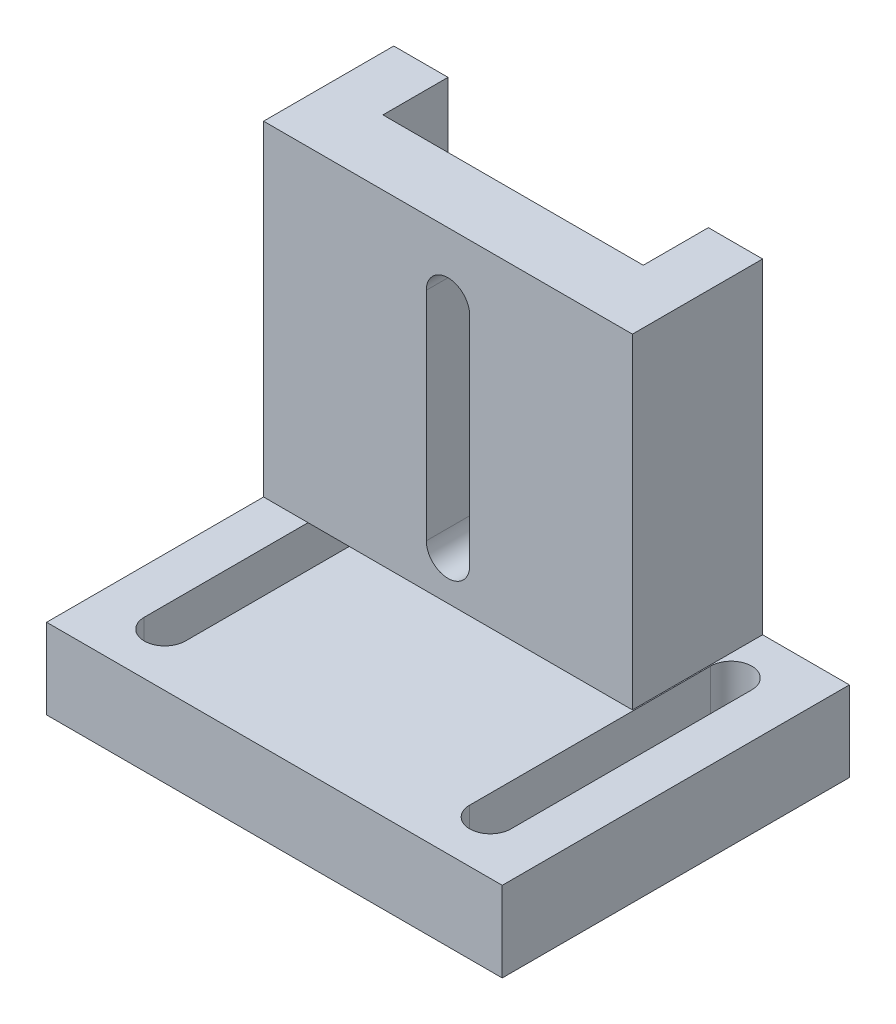
ISO-10303-21;
HEADER;
FILE_DESCRIPTION(('STEP AP214'),'2;1');
FILE_NAME('part.step','',(''),(''),'','','');
FILE_SCHEMA(('AUTOMOTIVE_DESIGN { 1 0 10303 214 1 1 1 1 }'));
ENDSEC;
DATA;
#1=APPLICATION_CONTEXT('core data for automotive mechanical design processes');
#2=APPLICATION_PROTOCOL_DEFINITION('international standard','automotive_design',2000,#1);
#3=PRODUCT_CONTEXT('',#1,'mechanical');
#4=PRODUCT('Part','Part','',(#3));
#5=PRODUCT_RELATED_PRODUCT_CATEGORY('part','',(#4));
#6=PRODUCT_DEFINITION_FORMATION('','',#4);
#7=PRODUCT_DEFINITION_CONTEXT('part definition',#1,'design');
#8=PRODUCT_DEFINITION('design','',#6,#7);
#9=PRODUCT_DEFINITION_SHAPE('','',#8);
#10=(LENGTH_UNIT() NAMED_UNIT(*) SI_UNIT(.MILLI.,.METRE.));
#11=(NAMED_UNIT(*) PLANE_ANGLE_UNIT() SI_UNIT($,.RADIAN.));
#12=(NAMED_UNIT(*) SI_UNIT($,.STERADIAN.) SOLID_ANGLE_UNIT());
#13=UNCERTAINTY_MEASURE_WITH_UNIT(LENGTH_MEASURE(1.E-05),#10,'distance_accuracy_value','');
#14=(GEOMETRIC_REPRESENTATION_CONTEXT(3) GLOBAL_UNCERTAINTY_ASSIGNED_CONTEXT((#13)) GLOBAL_UNIT_ASSIGNED_CONTEXT((#10,
#11,#12)) REPRESENTATION_CONTEXT('',''));
#15=CARTESIAN_POINT('',(0.,0.,0.));
#16=DIRECTION('',(0.,0.,1.));
#17=DIRECTION('',(1.,0.,0.));
#18=AXIS2_PLACEMENT_3D('',#15,#16,#17);
#19=CARTESIAN_POINT('',(0.,3.7,0.));
#20=DIRECTION('',(0.,1.,0.));
#21=DIRECTION('',(0.,0.,1.));
#22=AXIS2_PLACEMENT_3D('',#19,#20,#21);
#23=PLANE('',#22);
#24=DIRECTION('',(-1.,0.,0.));
#25=VECTOR('',#24,1.);
#26=CARTESIAN_POINT('',(-5.,3.7,-8.));
#27=LINE('',#26,#25);
#28=CARTESIAN_POINT('',(4.,3.7,-8.));
#29=VERTEX_POINT('',#28);
#30=CARTESIAN_POINT('',(-8.00000000000001,3.7,-8.));
#31=VERTEX_POINT('',#30);
#32=EDGE_CURVE('E390',#29,#31,#27,.T.);
#33=ORIENTED_EDGE('',*,*,#32,.T.);
#34=DIRECTION('',(0.,0.,1.));
#35=VECTOR('',#34,1.);
#36=CARTESIAN_POINT('',(-8.00000000000001,3.7,-8.));
#37=LINE('',#36,#35);
#38=CARTESIAN_POINT('',(-8.00000000000001,3.7,-6.35777472107018));
#39=VERTEX_POINT('',#38);
#40=EDGE_CURVE('E236',#31,#39,#37,.T.);
#41=ORIENTED_EDGE('',*,*,#40,.T.);
#42=CARTESIAN_POINT('',(-7.5,3.7,-5.55));
#43=DIRECTION('',(0.,1.,0.));
#44=DIRECTION('',(0.,0.,1.));
#45=AXIS2_PLACEMENT_3D('',#42,#43,#44);
#46=CIRCLE('',#45,0.95);
#47=CARTESIAN_POINT('',(-6.55,3.7,-5.55));
#48=VERTEX_POINT('',#47);
#49=EDGE_CURVE('E348',#48,#39,#46,.T.);
#50=ORIENTED_EDGE('',*,*,#49,.F.);
#51=DIRECTION('',(0.,0.,-1.));
#52=VECTOR('',#51,1.);
#53=CARTESIAN_POINT('',(-6.55,3.7,-5.55));
#54=LINE('',#53,#52);
#55=CARTESIAN_POINT('',(-6.55,3.7,-5.));
#56=VERTEX_POINT('',#55);
#57=EDGE_CURVE('E372',#56,#48,#54,.T.);
#58=ORIENTED_EDGE('',*,*,#57,.F.);
#59=DIRECTION('',(1.,0.,0.));
#60=VECTOR('',#59,1.);
#61=CARTESIAN_POINT('',(-10.5,3.7,-5.));
#62=LINE('',#61,#60);
#63=CARTESIAN_POINT('',(4.,3.7,-5.));
#64=VERTEX_POINT('',#63);
#65=EDGE_CURVE('E277',#56,#64,#62,.T.);
#66=ORIENTED_EDGE('',*,*,#65,.T.);
#67=DIRECTION('',(0.,0.,1.));
#68=VECTOR('',#67,1.);
#69=CARTESIAN_POINT('',(4.,3.7,-8.));
#70=LINE('',#69,#68);
#71=EDGE_CURVE('E303',#29,#64,#70,.T.);
#72=ORIENTED_EDGE('',*,*,#71,.F.);
#73=EDGE_LOOP('',(#33,#41,#50,#58,#66,#72));
#74=FACE_BOUND('',#73,.T.);
#75=ADVANCED_FACE('F33',(#74),#23,.T.);
#76=CARTESIAN_POINT('',(0.,0.,-5.));
#77=DIRECTION('',(0.,0.,1.));
#78=DIRECTION('',(1.,0.,0.));
#79=AXIS2_PLACEMENT_3D('',#76,#77,#78);
#80=PLANE('',#79);
#81=DIRECTION('',(0.,1.,0.));
#82=VECTOR('',#81,1.);
#83=CARTESIAN_POINT('',(-1.,15.7,-5.));
#84=LINE('',#83,#82);
#85=CARTESIAN_POINT('',(-1.,5.7,-5.));
#86=VERTEX_POINT('',#85);
#87=CARTESIAN_POINT('',(-1.,15.7,-5.));
#88=VERTEX_POINT('',#87);
#89=EDGE_CURVE('E253',#86,#88,#84,.T.);
#90=ORIENTED_EDGE('',*,*,#89,.T.);
#91=CARTESIAN_POINT('',(-2.,15.7,-5.));
#92=DIRECTION('',(0.,0.,1.));
#93=DIRECTION('',(-1.,0.,0.));
#94=AXIS2_PLACEMENT_3D('',#91,#92,#93);
#95=CIRCLE('',#94,1.);
#96=CARTESIAN_POINT('',(-3.,15.7,-5.));
#97=VERTEX_POINT('',#96);
#98=EDGE_CURVE('E243',#88,#97,#95,.T.);
#99=ORIENTED_EDGE('',*,*,#98,.T.);
#100=DIRECTION('',(0.,-1.,0.));
#101=VECTOR('',#100,1.);
#102=CARTESIAN_POINT('',(-3.,15.7,-5.));
#103=LINE('',#102,#101);
#104=CARTESIAN_POINT('',(-3.,5.7,-5.));
#105=VERTEX_POINT('',#104);
#106=EDGE_CURVE('E246',#97,#105,#103,.T.);
#107=ORIENTED_EDGE('',*,*,#106,.T.);
#108=CARTESIAN_POINT('',(-2.,5.7,-5.));
#109=DIRECTION('',(0.,0.,1.));
#110=DIRECTION('',(1.,0.,0.));
#111=AXIS2_PLACEMENT_3D('',#108,#109,#110);
#112=CIRCLE('',#111,1.);
#113=EDGE_CURVE('E250',#105,#86,#112,.T.);
#114=ORIENTED_EDGE('',*,*,#113,.T.);
#115=EDGE_LOOP('',(#90,#99,#107,#114));
#116=FACE_BOUND('',#115,.T.);
#117=DIRECTION('',(0.,-1.,0.));
#118=VECTOR('',#117,1.);
#119=CARTESIAN_POINT('',(-8.,18.7,-5.));
#120=LINE('',#119,#118);
#121=CARTESIAN_POINT('',(-8.,18.7,-5.));
#122=VERTEX_POINT('',#121);
#123=CARTESIAN_POINT('',(-8.,3.7,-5.));
#124=VERTEX_POINT('',#123);
#125=EDGE_CURVE('E50',#122,#124,#120,.T.);
#126=ORIENTED_EDGE('',*,*,#125,.F.);
#127=DIRECTION('',(-1.,0.,0.));
#128=VECTOR('',#127,1.);
#129=CARTESIAN_POINT('',(-10.5,18.7,-5.));
#130=LINE('',#129,#128);
#131=CARTESIAN_POINT('',(4.,18.7,-5.));
#132=VERTEX_POINT('',#131);
#133=EDGE_CURVE('E275',#132,#122,#130,.T.);
#134=ORIENTED_EDGE('',*,*,#133,.F.);
#135=DIRECTION('',(0.,1.,0.));
#136=VECTOR('',#135,1.);
#137=CARTESIAN_POINT('',(4.,18.7,-5.));
#138=LINE('',#137,#136);
#139=EDGE_CURVE('E290',#64,#132,#138,.T.);
#140=ORIENTED_EDGE('',*,*,#139,.F.);
#141=ORIENTED_EDGE('',*,*,#65,.F.);
#142=EDGE_CURVE('E223',#124,#56,#62,.T.);
#143=ORIENTED_EDGE('',*,*,#142,.F.);
#144=EDGE_LOOP('',(#126,#134,#140,#141,#143));
#145=FACE_BOUND('',#144,.T.);
#146=ADVANCED_FACE('F408',(#116,#145),#80,.F.);
#147=DIRECTION('',(1.,0.,0.));
#148=VECTOR('',#147,1.);
#149=CARTESIAN_POINT('',(-10.5,3.7,-2.));
#150=LINE('',#149,#148);
#151=CARTESIAN_POINT('',(-10.5,3.7,-2.));
#152=VERTEX_POINT('',#151);
#153=CARTESIAN_POINT('',(-8.45,3.7,-2.));
#154=VERTEX_POINT('',#153);
#155=EDGE_CURVE('E278',#152,#154,#150,.T.);
#156=ORIENTED_EDGE('',*,*,#155,.F.);
#157=DIRECTION('',(0.,0.,-1.));
#158=VECTOR('',#157,1.);
#159=CARTESIAN_POINT('',(-10.5,3.7,8.));
#160=LINE('',#159,#158);
#161=CARTESIAN_POINT('',(-10.5,3.7,8.));
#162=VERTEX_POINT('',#161);
#163=EDGE_CURVE('E212',#162,#152,#160,.T.);
#164=ORIENTED_EDGE('',*,*,#163,.F.);
#165=DIRECTION('',(1.,0.,0.));
#166=VECTOR('',#165,1.);
#167=CARTESIAN_POINT('',(-5.,3.7,8.));
#168=LINE('',#167,#166);
#169=CARTESIAN_POINT('',(10.5,3.7,8.));
#170=VERTEX_POINT('',#169);
#171=EDGE_CURVE('E11',#162,#170,#168,.T.);
#172=ORIENTED_EDGE('',*,*,#171,.T.);
#173=DIRECTION('',(0.,0.,-1.));
#174=VECTOR('',#173,1.);
#175=CARTESIAN_POINT('',(10.5,3.7,8.));
#176=LINE('',#175,#174);
#177=CARTESIAN_POINT('',(10.5,3.7,-8.));
#178=VERTEX_POINT('',#177);
#179=EDGE_CURVE('E340',#170,#178,#176,.T.);
#180=ORIENTED_EDGE('',*,*,#179,.T.);
#181=CARTESIAN_POINT('',(6.5,3.7,-8.));
#182=VERTEX_POINT('',#181);
#183=EDGE_CURVE('E42',#178,#182,#27,.T.);
#184=ORIENTED_EDGE('',*,*,#183,.T.);
#185=DIRECTION('',(0.,0.,1.));
#186=VECTOR('',#185,1.);
#187=CARTESIAN_POINT('',(6.5,3.7,-8.));
#188=LINE('',#187,#186);
#189=CARTESIAN_POINT('',(6.5,3.7,-2.));
#190=VERTEX_POINT('',#189);
#191=EDGE_CURVE('E306',#182,#190,#188,.T.);
#192=ORIENTED_EDGE('',*,*,#191,.T.);
#193=CARTESIAN_POINT('',(-6.55,3.7,-2.));
#194=VERTEX_POINT('',#193);
#195=EDGE_CURVE('E285',#194,#190,#150,.T.);
#196=ORIENTED_EDGE('',*,*,#195,.F.);
#197=CARTESIAN_POINT('',(-6.55,3.7,5.55));
#198=VERTEX_POINT('',#197);
#199=EDGE_CURVE('E355',#198,#194,#54,.T.);
#200=ORIENTED_EDGE('',*,*,#199,.F.);
#201=CARTESIAN_POINT('',(-7.5,3.7,5.55));
#202=DIRECTION('',(0.,1.,0.));
#203=DIRECTION('',(0.,0.,1.));
#204=AXIS2_PLACEMENT_3D('',#201,#202,#203);
#205=CIRCLE('',#204,0.95);
#206=CARTESIAN_POINT('',(-8.45,3.7,5.55));
#207=VERTEX_POINT('',#206);
#208=EDGE_CURVE('E369',#207,#198,#205,.T.);
#209=ORIENTED_EDGE('',*,*,#208,.F.);
#210=DIRECTION('',(0.,0.,1.));
#211=VECTOR('',#210,1.);
#212=CARTESIAN_POINT('',(-8.45,3.7,-5.55));
#213=LINE('',#212,#211);
#214=EDGE_CURVE('E367',#154,#207,#213,.T.);
#215=ORIENTED_EDGE('',*,*,#214,.F.);
#216=EDGE_LOOP('',(#156,#164,#172,#180,#184,#192,#196,#200,#209,#215));
#217=FACE_BOUND('',#216,.T.);
#218=DIRECTION('',(0.,0.,-1.));
#219=VECTOR('',#218,1.);
#220=CARTESIAN_POINT('',(6.55,3.7,-5.55));
#221=LINE('',#220,#219);
#222=CARTESIAN_POINT('',(6.55,3.7,5.55));
#223=VERTEX_POINT('',#222);
#224=CARTESIAN_POINT('',(6.55,3.7,-5.55));
#225=VERTEX_POINT('',#224);
#226=EDGE_CURVE('E322',#223,#225,#221,.T.);
#227=ORIENTED_EDGE('',*,*,#226,.T.);
#228=CARTESIAN_POINT('',(7.5,3.7,-5.55));
#229=DIRECTION('',(0.,-1.,0.));
#230=DIRECTION('',(0.,0.,1.));
#231=AXIS2_PLACEMENT_3D('',#228,#229,#230);
#232=CIRCLE('',#231,0.95);
#233=CARTESIAN_POINT('',(8.45,3.7,-5.55));
#234=VERTEX_POINT('',#233);
#235=EDGE_CURVE('E308',#225,#234,#232,.T.);
#236=ORIENTED_EDGE('',*,*,#235,.T.);
#237=DIRECTION('',(0.,0.,1.));
#238=VECTOR('',#237,1.);
#239=CARTESIAN_POINT('',(8.45,3.7,-5.55));
#240=LINE('',#239,#238);
#241=CARTESIAN_POINT('',(8.45,3.7,5.55));
#242=VERTEX_POINT('',#241);
#243=EDGE_CURVE('E312',#234,#242,#240,.T.);
#244=ORIENTED_EDGE('',*,*,#243,.T.);
#245=CARTESIAN_POINT('',(7.5,3.7,5.55));
#246=DIRECTION('',(0.,-1.,0.));
#247=DIRECTION('',(0.,0.,1.));
#248=AXIS2_PLACEMENT_3D('',#245,#246,#247);
#249=CIRCLE('',#248,0.95);
#250=EDGE_CURVE('E325',#242,#223,#249,.T.);
#251=ORIENTED_EDGE('',*,*,#250,.T.);
#252=EDGE_LOOP('',(#227,#236,#244,#251));
#253=FACE_BOUND('',#252,.T.);
#254=ADVANCED_FACE('F423',(#217,#253),#23,.T.);
#255=CARTESIAN_POINT('',(0.,0.,0.));
#256=DIRECTION('',(0.,1.,0.));
#257=DIRECTION('',(0.,0.,1.));
#258=AXIS2_PLACEMENT_3D('',#255,#256,#257);
#259=PLANE('',#258);
#260=DIRECTION('',(-1.,0.,0.));
#261=VECTOR('',#260,1.);
#262=CARTESIAN_POINT('',(-5.,0.,-8.));
#263=LINE('',#262,#261);
#264=CARTESIAN_POINT('',(10.5,0.,-8.));
#265=VERTEX_POINT('',#264);
#266=CARTESIAN_POINT('',(-10.5,0.,-8.));
#267=VERTEX_POINT('',#266);
#268=EDGE_CURVE('E207',#265,#267,#263,.T.);
#269=ORIENTED_EDGE('',*,*,#268,.F.);
#270=DIRECTION('',(0.,0.,-1.));
#271=VECTOR('',#270,1.);
#272=CARTESIAN_POINT('',(10.5,0.,8.));
#273=LINE('',#272,#271);
#274=CARTESIAN_POINT('',(10.5,0.,8.));
#275=VERTEX_POINT('',#274);
#276=EDGE_CURVE('E333',#275,#265,#273,.T.);
#277=ORIENTED_EDGE('',*,*,#276,.F.);
#278=DIRECTION('',(1.,0.,0.));
#279=VECTOR('',#278,1.);
#280=CARTESIAN_POINT('',(-5.,0.,8.));
#281=LINE('',#280,#279);
#282=CARTESIAN_POINT('',(-10.5,0.,8.));
#283=VERTEX_POINT('',#282);
#284=EDGE_CURVE('E37',#283,#275,#281,.T.);
#285=ORIENTED_EDGE('',*,*,#284,.F.);
#286=DIRECTION('',(0.,0.,-1.));
#287=VECTOR('',#286,1.);
#288=CARTESIAN_POINT('',(-10.5,0.,8.));
#289=LINE('',#288,#287);
#290=EDGE_CURVE('E378',#283,#267,#289,.T.);
#291=ORIENTED_EDGE('',*,*,#290,.T.);
#292=EDGE_LOOP('',(#269,#277,#285,#291));
#293=FACE_BOUND('',#292,.T.);
#294=DIRECTION('',(0.,0.,-1.));
#295=VECTOR('',#294,1.);
#296=CARTESIAN_POINT('',(-6.55,0.,-5.55));
#297=LINE('',#296,#295);
#298=CARTESIAN_POINT('',(-6.55,0.,5.55));
#299=VERTEX_POINT('',#298);
#300=CARTESIAN_POINT('',(-6.55,0.,-5.55));
#301=VERTEX_POINT('',#300);
#302=EDGE_CURVE('E361',#299,#301,#297,.T.);
#303=ORIENTED_EDGE('',*,*,#302,.T.);
#304=CARTESIAN_POINT('',(-7.5,0.,-5.55));
#305=DIRECTION('',(0.,1.,0.));
#306=DIRECTION('',(0.,0.,1.));
#307=AXIS2_PLACEMENT_3D('',#304,#305,#306);
#308=CIRCLE('',#307,0.95);
#309=CARTESIAN_POINT('',(-8.45,0.,-5.55));
#310=VERTEX_POINT('',#309);
#311=EDGE_CURVE('E351',#301,#310,#308,.T.);
#312=ORIENTED_EDGE('',*,*,#311,.T.);
#313=DIRECTION('',(0.,0.,1.));
#314=VECTOR('',#313,1.);
#315=CARTESIAN_POINT('',(-8.45,0.,-5.55));
#316=LINE('',#315,#314);
#317=CARTESIAN_POINT('',(-8.45,0.,5.55));
#318=VERTEX_POINT('',#317);
#319=EDGE_CURVE('E354',#310,#318,#316,.T.);
#320=ORIENTED_EDGE('',*,*,#319,.T.);
#321=CARTESIAN_POINT('',(-7.5,0.,5.55));
#322=DIRECTION('',(0.,1.,0.));
#323=DIRECTION('',(0.,0.,1.));
#324=AXIS2_PLACEMENT_3D('',#321,#322,#323);
#325=CIRCLE('',#324,0.95);
#326=EDGE_CURVE('E358',#318,#299,#325,.T.);
#327=ORIENTED_EDGE('',*,*,#326,.T.);
#328=EDGE_LOOP('',(#303,#312,#320,#327));
#329=FACE_BOUND('',#328,.T.);
#330=CARTESIAN_POINT('',(7.5,0.,-5.55));
#331=DIRECTION('',(0.,-1.,0.));
#332=DIRECTION('',(0.,0.,1.));
#333=AXIS2_PLACEMENT_3D('',#330,#331,#332);
#334=CIRCLE('',#333,0.95);
#335=CARTESIAN_POINT('',(6.55,0.,-5.55));
#336=VERTEX_POINT('',#335);
#337=CARTESIAN_POINT('',(8.45,0.,-5.55));
#338=VERTEX_POINT('',#337);
#339=EDGE_CURVE('E309',#336,#338,#334,.T.);
#340=ORIENTED_EDGE('',*,*,#339,.F.);
#341=DIRECTION('',(0.,0.,-1.));
#342=VECTOR('',#341,1.);
#343=CARTESIAN_POINT('',(6.55,0.,-5.55));
#344=LINE('',#343,#342);
#345=CARTESIAN_POINT('',(6.55,0.,5.55));
#346=VERTEX_POINT('',#345);
#347=EDGE_CURVE('E311',#346,#336,#344,.T.);
#348=ORIENTED_EDGE('',*,*,#347,.F.);
#349=CARTESIAN_POINT('',(7.5,0.,5.55));
#350=DIRECTION('',(0.,-1.,0.));
#351=DIRECTION('',(0.,0.,1.));
#352=AXIS2_PLACEMENT_3D('',#349,#350,#351);
#353=CIRCLE('',#352,0.95);
#354=CARTESIAN_POINT('',(8.45,0.,5.55));
#355=VERTEX_POINT('',#354);
#356=EDGE_CURVE('E314',#355,#346,#353,.T.);
#357=ORIENTED_EDGE('',*,*,#356,.F.);
#358=DIRECTION('',(0.,0.,1.));
#359=VECTOR('',#358,1.);
#360=CARTESIAN_POINT('',(8.45,0.,-5.55));
#361=LINE('',#360,#359);
#362=EDGE_CURVE('E317',#338,#355,#361,.T.);
#363=ORIENTED_EDGE('',*,*,#362,.F.);
#364=EDGE_LOOP('',(#340,#348,#357,#363));
#365=FACE_BOUND('',#364,.T.);
#366=ADVANCED_FACE('F439',(#293,#329,#365),#259,.F.);
#367=CARTESIAN_POINT('',(-5.,3.7,-8.));
#368=DIRECTION('',(0.,0.,1.));
#369=DIRECTION('',(1.,0.,0.));
#370=AXIS2_PLACEMENT_3D('',#367,#368,#369);
#371=PLANE('',#370);
#372=ORIENTED_EDGE('',*,*,#268,.T.);
#373=DIRECTION('',(0.,-1.,0.));
#374=VECTOR('',#373,1.);
#375=CARTESIAN_POINT('',(-10.5,3.7,-8.));
#376=LINE('',#375,#374);
#377=CARTESIAN_POINT('',(-10.5,18.7,-8.));
#378=VERTEX_POINT('',#377);
#379=EDGE_CURVE('E201',#378,#267,#376,.T.);
#380=ORIENTED_EDGE('',*,*,#379,.F.);
#381=DIRECTION('',(1.,0.,0.));
#382=VECTOR('',#381,1.);
#383=CARTESIAN_POINT('',(-10.5,18.7,-8.));
#384=LINE('',#383,#382);
#385=CARTESIAN_POINT('',(-8.,18.7,-8.));
#386=VERTEX_POINT('',#385);
#387=EDGE_CURVE('E204',#378,#386,#384,.T.);
#388=ORIENTED_EDGE('',*,*,#387,.T.);
#389=DIRECTION('',(0.,-1.,0.));
#390=VECTOR('',#389,1.);
#391=CARTESIAN_POINT('',(-8.,18.7,-8.));
#392=LINE('',#391,#390);
#393=EDGE_CURVE('E230',#386,#31,#392,.T.);
#394=ORIENTED_EDGE('',*,*,#393,.T.);
#395=ORIENTED_EDGE('',*,*,#32,.F.);
#396=DIRECTION('',(0.,1.,0.));
#397=VECTOR('',#396,1.);
#398=CARTESIAN_POINT('',(4.,18.7,-8.));
#399=LINE('',#398,#397);
#400=CARTESIAN_POINT('',(4.,18.7,-8.));
#401=VERTEX_POINT('',#400);
#402=EDGE_CURVE('E293',#29,#401,#399,.T.);
#403=ORIENTED_EDGE('',*,*,#402,.T.);
#404=DIRECTION('',(1.,0.,0.));
#405=VECTOR('',#404,1.);
#406=CARTESIAN_POINT('',(6.5,18.7,-8.));
#407=LINE('',#406,#405);
#408=CARTESIAN_POINT('',(6.5,18.7,-8.));
#409=VERTEX_POINT('',#408);
#410=EDGE_CURVE('E295',#401,#409,#407,.T.);
#411=ORIENTED_EDGE('',*,*,#410,.T.);
#412=DIRECTION('',(0.,-1.,0.));
#413=VECTOR('',#412,1.);
#414=CARTESIAN_POINT('',(6.5,18.7,-8.));
#415=LINE('',#414,#413);
#416=EDGE_CURVE('E291',#409,#182,#415,.T.);
#417=ORIENTED_EDGE('',*,*,#416,.T.);
#418=ORIENTED_EDGE('',*,*,#183,.F.);
#419=DIRECTION('',(0.,-1.,0.));
#420=VECTOR('',#419,1.);
#421=CARTESIAN_POINT('',(10.5,3.7,-8.));
#422=LINE('',#421,#420);
#423=EDGE_CURVE('E346',#178,#265,#422,.T.);
#424=ORIENTED_EDGE('',*,*,#423,.T.);
#425=EDGE_LOOP('',(#372,#380,#388,#394,#395,#403,#411,#417,#418,#424));
#426=FACE_BOUND('',#425,.T.);
#427=ADVANCED_FACE('F35',(#426),#371,.F.);
#428=CARTESIAN_POINT('',(-5.,3.7,8.));
#429=DIRECTION('',(0.,0.,-1.));
#430=DIRECTION('',(-1.,0.,0.));
#431=AXIS2_PLACEMENT_3D('',#428,#429,#430);
#432=PLANE('',#431);
#433=ORIENTED_EDGE('',*,*,#284,.T.);
#434=DIRECTION('',(0.,-1.,0.));
#435=VECTOR('',#434,1.);
#436=CARTESIAN_POINT('',(10.5,3.7,8.));
#437=LINE('',#436,#435);
#438=EDGE_CURVE('E343',#170,#275,#437,.T.);
#439=ORIENTED_EDGE('',*,*,#438,.F.);
#440=ORIENTED_EDGE('',*,*,#171,.F.);
#441=DIRECTION('',(0.,-1.,0.));
#442=VECTOR('',#441,1.);
#443=CARTESIAN_POINT('',(-10.5,3.7,8.));
#444=LINE('',#443,#442);
#445=EDGE_CURVE('E211',#162,#283,#444,.T.);
#446=ORIENTED_EDGE('',*,*,#445,.T.);
#447=EDGE_LOOP('',(#433,#439,#440,#446));
#448=FACE_BOUND('',#447,.T.);
#449=ADVANCED_FACE('F459',(#448),#432,.F.);
#450=CARTESIAN_POINT('',(-10.5,3.7,8.));
#451=DIRECTION('',(-1.,0.,0.));
#452=DIRECTION('',(0.,0.,1.));
#453=AXIS2_PLACEMENT_3D('',#450,#451,#452);
#454=PLANE('',#453);
#455=DIRECTION('',(0.,0.,1.));
#456=VECTOR('',#455,1.);
#457=CARTESIAN_POINT('',(-10.5,18.7,-5.));
#458=LINE('',#457,#456);
#459=CARTESIAN_POINT('',(-10.5,18.7,-2.));
#460=VERTEX_POINT('',#459);
#461=EDGE_CURVE('E215',#378,#460,#458,.T.);
#462=ORIENTED_EDGE('',*,*,#461,.F.);
#463=ORIENTED_EDGE('',*,*,#379,.T.);
#464=ORIENTED_EDGE('',*,*,#290,.F.);
#465=ORIENTED_EDGE('',*,*,#445,.F.);
#466=ORIENTED_EDGE('',*,*,#163,.T.);
#467=DIRECTION('',(0.,-1.,0.));
#468=VECTOR('',#467,1.);
#469=CARTESIAN_POINT('',(-10.5,3.7,-2.));
#470=LINE('',#469,#468);
#471=EDGE_CURVE('E218',#460,#152,#470,.T.);
#472=ORIENTED_EDGE('',*,*,#471,.F.);
#473=EDGE_LOOP('',(#462,#463,#464,#465,#466,#472));
#474=FACE_BOUND('',#473,.T.);
#475=ADVANCED_FACE('F216',(#474),#454,.T.);
#476=CARTESIAN_POINT('',(-7.5,0.,-5.55));
#477=DIRECTION('',(0.,1.,0.));
#478=DIRECTION('',(0.,0.,1.));
#479=AXIS2_PLACEMENT_3D('',#476,#477,#478);
#480=CYLINDRICAL_SURFACE('',#479,0.95);
#481=ORIENTED_EDGE('',*,*,#49,.T.);
#482=CARTESIAN_POINT('',(-7.5,3.7,-5.55));
#483=DIRECTION('',(0.,1.,0.));
#484=DIRECTION('',(0.,0.,1.));
#485=AXIS2_PLACEMENT_3D('',#482,#483,#484);
#486=CIRCLE('',#485,0.95);
#487=CARTESIAN_POINT('',(-8.45,3.7,-5.55));
#488=VERTEX_POINT('',#487);
#489=EDGE_CURVE('E240',#488,#39,#486,.F.);
#490=ORIENTED_EDGE('',*,*,#489,.F.);
#491=DIRECTION('',(0.,1.,0.));
#492=VECTOR('',#491,1.);
#493=CARTESIAN_POINT('',(-8.45,0.,-5.55));
#494=LINE('',#493,#492);
#495=EDGE_CURVE('E364',#310,#488,#494,.T.);
#496=ORIENTED_EDGE('',*,*,#495,.F.);
#497=ORIENTED_EDGE('',*,*,#311,.F.);
#498=DIRECTION('',(0.,1.,0.));
#499=VECTOR('',#498,1.);
#500=CARTESIAN_POINT('',(-6.55,0.,-5.55));
#501=LINE('',#500,#499);
#502=EDGE_CURVE('E375',#301,#48,#501,.T.);
#503=ORIENTED_EDGE('',*,*,#502,.T.);
#504=EDGE_LOOP('',(#481,#490,#496,#497,#503));
#505=FACE_BOUND('',#504,.T.);
#506=ADVANCED_FACE('F451',(#505),#480,.F.);
#507=CARTESIAN_POINT('',(-6.55,0.,-5.55));
#508=DIRECTION('',(1.,0.,0.));
#509=DIRECTION('',(0.,0.,-1.));
#510=AXIS2_PLACEMENT_3D('',#507,#508,#509);
#511=PLANE('',#510);
#512=ORIENTED_EDGE('',*,*,#199,.T.);
#513=DIRECTION('',(0.,0.,-1.));
#514=VECTOR('',#513,1.);
#515=CARTESIAN_POINT('',(-6.55,3.7,-5.55));
#516=LINE('',#515,#514);
#517=EDGE_CURVE('E222',#194,#56,#516,.T.);
#518=ORIENTED_EDGE('',*,*,#517,.T.);
#519=ORIENTED_EDGE('',*,*,#57,.T.);
#520=ORIENTED_EDGE('',*,*,#502,.F.);
#521=ORIENTED_EDGE('',*,*,#302,.F.);
#522=DIRECTION('',(0.,1.,0.));
#523=VECTOR('',#522,1.);
#524=CARTESIAN_POINT('',(-6.55,0.,5.55));
#525=LINE('',#524,#523);
#526=EDGE_CURVE('E379',#299,#198,#525,.T.);
#527=ORIENTED_EDGE('',*,*,#526,.T.);
#528=EDGE_LOOP('',(#512,#518,#519,#520,#521,#527));
#529=FACE_BOUND('',#528,.T.);
#530=ADVANCED_FACE('F411',(#529),#511,.F.);
#531=CARTESIAN_POINT('',(-7.5,0.,5.55));
#532=DIRECTION('',(0.,1.,0.));
#533=DIRECTION('',(0.,0.,1.));
#534=AXIS2_PLACEMENT_3D('',#531,#532,#533);
#535=CYLINDRICAL_SURFACE('',#534,0.95);
#536=ORIENTED_EDGE('',*,*,#208,.T.);
#537=ORIENTED_EDGE('',*,*,#526,.F.);
#538=ORIENTED_EDGE('',*,*,#326,.F.);
#539=DIRECTION('',(0.,1.,0.));
#540=VECTOR('',#539,1.);
#541=CARTESIAN_POINT('',(-8.45,0.,5.55));
#542=LINE('',#541,#540);
#543=EDGE_CURVE('E381',#318,#207,#542,.T.);
#544=ORIENTED_EDGE('',*,*,#543,.T.);
#545=EDGE_LOOP('',(#536,#537,#538,#544));
#546=FACE_BOUND('',#545,.T.);
#547=ADVANCED_FACE('F446',(#546),#535,.F.);
#548=CARTESIAN_POINT('',(-8.45,0.,-5.55));
#549=DIRECTION('',(-1.,0.,0.));
#550=DIRECTION('',(0.,0.,1.));
#551=AXIS2_PLACEMENT_3D('',#548,#549,#550);
#552=PLANE('',#551);
#553=EDGE_CURVE('E58',#488,#154,#213,.T.);
#554=ORIENTED_EDGE('',*,*,#553,.T.);
#555=ORIENTED_EDGE('',*,*,#214,.T.);
#556=ORIENTED_EDGE('',*,*,#543,.F.);
#557=ORIENTED_EDGE('',*,*,#319,.F.);
#558=ORIENTED_EDGE('',*,*,#495,.T.);
#559=EDGE_LOOP('',(#554,#555,#556,#557,#558));
#560=FACE_BOUND('',#559,.T.);
#561=ADVANCED_FACE('F443',(#560),#552,.F.);
#562=CARTESIAN_POINT('',(10.5,3.7,8.));
#563=DIRECTION('',(-1.,0.,0.));
#564=DIRECTION('',(0.,0.,1.));
#565=AXIS2_PLACEMENT_3D('',#562,#563,#564);
#566=PLANE('',#565);
#567=ORIENTED_EDGE('',*,*,#276,.T.);
#568=ORIENTED_EDGE('',*,*,#423,.F.);
#569=ORIENTED_EDGE('',*,*,#179,.F.);
#570=ORIENTED_EDGE('',*,*,#438,.T.);
#571=EDGE_LOOP('',(#567,#568,#569,#570));
#572=FACE_BOUND('',#571,.T.);
#573=ADVANCED_FACE('F436',(#572),#566,.F.);
#574=CARTESIAN_POINT('',(7.5,0.,-5.55));
#575=DIRECTION('',(0.,1.,0.));
#576=DIRECTION('',(0.,0.,1.));
#577=AXIS2_PLACEMENT_3D('',#574,#575,#576);
#578=CYLINDRICAL_SURFACE('',#577,0.95);
#579=ORIENTED_EDGE('',*,*,#235,.F.);
#580=DIRECTION('',(0.,1.,0.));
#581=VECTOR('',#580,1.);
#582=CARTESIAN_POINT('',(6.55,0.,-5.55));
#583=LINE('',#582,#581);
#584=EDGE_CURVE('E319',#336,#225,#583,.T.);
#585=ORIENTED_EDGE('',*,*,#584,.F.);
#586=ORIENTED_EDGE('',*,*,#339,.T.);
#587=DIRECTION('',(0.,1.,0.));
#588=VECTOR('',#587,1.);
#589=CARTESIAN_POINT('',(8.45,0.,-5.55));
#590=LINE('',#589,#588);
#591=EDGE_CURVE('E330',#338,#234,#590,.T.);
#592=ORIENTED_EDGE('',*,*,#591,.T.);
#593=EDGE_LOOP('',(#579,#585,#586,#592));
#594=FACE_BOUND('',#593,.T.);
#595=ADVANCED_FACE('F618',(#594),#578,.F.);
#596=CARTESIAN_POINT('',(8.45,0.,-5.55));
#597=DIRECTION('',(-1.,0.,0.));
#598=DIRECTION('',(0.,0.,1.));
#599=AXIS2_PLACEMENT_3D('',#596,#597,#598);
#600=PLANE('',#599);
#601=ORIENTED_EDGE('',*,*,#243,.F.);
#602=ORIENTED_EDGE('',*,*,#591,.F.);
#603=ORIENTED_EDGE('',*,*,#362,.T.);
#604=DIRECTION('',(0.,1.,0.));
#605=VECTOR('',#604,1.);
#606=CARTESIAN_POINT('',(8.45,0.,5.55));
#607=LINE('',#606,#605);
#608=EDGE_CURVE('E334',#355,#242,#607,.T.);
#609=ORIENTED_EDGE('',*,*,#608,.T.);
#610=EDGE_LOOP('',(#601,#602,#603,#609));
#611=FACE_BOUND('',#610,.T.);
#612=ADVANCED_FACE('F614',(#611),#600,.T.);
#613=CARTESIAN_POINT('',(7.5,0.,5.55));
#614=DIRECTION('',(0.,1.,0.));
#615=DIRECTION('',(0.,0.,1.));
#616=AXIS2_PLACEMENT_3D('',#613,#614,#615);
#617=CYLINDRICAL_SURFACE('',#616,0.95);
#618=ORIENTED_EDGE('',*,*,#250,.F.);
#619=ORIENTED_EDGE('',*,*,#608,.F.);
#620=ORIENTED_EDGE('',*,*,#356,.T.);
#621=DIRECTION('',(0.,1.,0.));
#622=VECTOR('',#621,1.);
#623=CARTESIAN_POINT('',(6.55,0.,5.55));
#624=LINE('',#623,#622);
#625=EDGE_CURVE('E336',#346,#223,#624,.T.);
#626=ORIENTED_EDGE('',*,*,#625,.T.);
#627=EDGE_LOOP('',(#618,#619,#620,#626));
#628=FACE_BOUND('',#627,.T.);
#629=ADVANCED_FACE('F617',(#628),#617,.F.);
#630=CARTESIAN_POINT('',(6.55,0.,-5.55));
#631=DIRECTION('',(1.,0.,0.));
#632=DIRECTION('',(0.,0.,-1.));
#633=AXIS2_PLACEMENT_3D('',#630,#631,#632);
#634=PLANE('',#633);
#635=ORIENTED_EDGE('',*,*,#226,.F.);
#636=ORIENTED_EDGE('',*,*,#625,.F.);
#637=ORIENTED_EDGE('',*,*,#347,.T.);
#638=ORIENTED_EDGE('',*,*,#584,.T.);
#639=EDGE_LOOP('',(#635,#636,#637,#638));
#640=FACE_BOUND('',#639,.T.);
#641=ADVANCED_FACE('F522',(#640),#634,.T.);
#642=CARTESIAN_POINT('',(6.5,18.7,-8.));
#643=DIRECTION('',(-1.,0.,0.));
#644=DIRECTION('',(0.,-1.,0.));
#645=AXIS2_PLACEMENT_3D('',#642,#643,#644);
#646=PLANE('',#645);
#647=DIRECTION('',(0.,0.,1.));
#648=VECTOR('',#647,1.);
#649=CARTESIAN_POINT('',(6.5,18.7,-8.));
#650=LINE('',#649,#648);
#651=CARTESIAN_POINT('',(6.5,18.7,-2.));
#652=VERTEX_POINT('',#651);
#653=EDGE_CURVE('E297',#409,#652,#650,.T.);
#654=ORIENTED_EDGE('',*,*,#653,.T.);
#655=DIRECTION('',(0.,1.,0.));
#656=VECTOR('',#655,1.);
#657=CARTESIAN_POINT('',(6.5,18.7,-2.));
#658=LINE('',#657,#656);
#659=EDGE_CURVE('E268',#190,#652,#658,.T.);
#660=ORIENTED_EDGE('',*,*,#659,.F.);
#661=ORIENTED_EDGE('',*,*,#191,.F.);
#662=ORIENTED_EDGE('',*,*,#416,.F.);
#663=EDGE_LOOP('',(#654,#660,#661,#662));
#664=FACE_BOUND('',#663,.T.);
#665=ADVANCED_FACE('F429',(#664),#646,.F.);
#666=CARTESIAN_POINT('',(4.,18.7,-8.));
#667=DIRECTION('',(1.,0.,0.));
#668=DIRECTION('',(0.,1.,0.));
#669=AXIS2_PLACEMENT_3D('',#666,#667,#668);
#670=PLANE('',#669);
#671=ORIENTED_EDGE('',*,*,#139,.T.);
#672=DIRECTION('',(0.,0.,1.));
#673=VECTOR('',#672,1.);
#674=CARTESIAN_POINT('',(4.,18.7,-8.));
#675=LINE('',#674,#673);
#676=EDGE_CURVE('E301',#401,#132,#675,.T.);
#677=ORIENTED_EDGE('',*,*,#676,.F.);
#678=ORIENTED_EDGE('',*,*,#402,.F.);
#679=ORIENTED_EDGE('',*,*,#71,.T.);
#680=EDGE_LOOP('',(#671,#677,#678,#679));
#681=FACE_BOUND('',#680,.T.);
#682=ADVANCED_FACE('F521',(#681),#670,.F.);
#683=CARTESIAN_POINT('',(6.5,18.7,-8.));
#684=DIRECTION('',(0.,-1.,0.));
#685=DIRECTION('',(0.,0.,-1.));
#686=AXIS2_PLACEMENT_3D('',#683,#684,#685);
#687=PLANE('',#686);
#688=ORIENTED_EDGE('',*,*,#676,.T.);
#689=ORIENTED_EDGE('',*,*,#133,.T.);
#690=DIRECTION('',(0.,0.,1.));
#691=VECTOR('',#690,1.);
#692=CARTESIAN_POINT('',(-8.,18.7,-8.));
#693=LINE('',#692,#691);
#694=EDGE_CURVE('E228',#386,#122,#693,.T.);
#695=ORIENTED_EDGE('',*,*,#694,.F.);
#696=ORIENTED_EDGE('',*,*,#387,.F.);
#697=ORIENTED_EDGE('',*,*,#461,.T.);
#698=DIRECTION('',(-1.,0.,0.));
#699=VECTOR('',#698,1.);
#700=CARTESIAN_POINT('',(-10.5,18.7,-2.));
#701=LINE('',#700,#699);
#702=EDGE_CURVE('E282',#652,#460,#701,.T.);
#703=ORIENTED_EDGE('',*,*,#702,.F.);
#704=ORIENTED_EDGE('',*,*,#653,.F.);
#705=ORIENTED_EDGE('',*,*,#410,.F.);
#706=EDGE_LOOP('',(#688,#689,#695,#696,#697,#703,#704,#705));
#707=FACE_BOUND('',#706,.T.);
#708=ADVANCED_FACE('F226',(#707),#687,.F.);
#709=CARTESIAN_POINT('',(-10.5,3.7,-5.));
#710=DIRECTION('',(0.,-1.,0.));
#711=DIRECTION('',(1.,0.,0.));
#712=AXIS2_PLACEMENT_3D('',#709,#710,#711);
#713=PLANE('',#712);
#714=ORIENTED_EDGE('',*,*,#517,.F.);
#715=EDGE_CURVE('E286',#154,#194,#150,.T.);
#716=ORIENTED_EDGE('',*,*,#715,.F.);
#717=ORIENTED_EDGE('',*,*,#553,.F.);
#718=ORIENTED_EDGE('',*,*,#489,.T.);
#719=EDGE_CURVE('E232',#39,#124,#37,.T.);
#720=ORIENTED_EDGE('',*,*,#719,.T.);
#721=ORIENTED_EDGE('',*,*,#142,.T.);
#722=EDGE_LOOP('',(#714,#716,#717,#718,#720,#721));
#723=FACE_BOUND('',#722,.T.);
#724=ADVANCED_FACE('F404',(#723),#713,.T.);
#725=CARTESIAN_POINT('',(0.,0.,-2.));
#726=DIRECTION('',(0.,0.,1.));
#727=DIRECTION('',(1.,0.,0.));
#728=AXIS2_PLACEMENT_3D('',#725,#726,#727);
#729=PLANE('',#728);
#730=CARTESIAN_POINT('',(-2.,15.7,-2.));
#731=DIRECTION('',(0.,0.,1.));
#732=DIRECTION('',(-1.,0.,0.));
#733=AXIS2_PLACEMENT_3D('',#730,#731,#732);
#734=CIRCLE('',#733,1.);
#735=CARTESIAN_POINT('',(-1.,15.7,-2.));
#736=VERTEX_POINT('',#735);
#737=CARTESIAN_POINT('',(-3.,15.7,-2.));
#738=VERTEX_POINT('',#737);
#739=EDGE_CURVE('E242',#736,#738,#734,.T.);
#740=ORIENTED_EDGE('',*,*,#739,.F.);
#741=DIRECTION('',(0.,1.,0.));
#742=VECTOR('',#741,1.);
#743=CARTESIAN_POINT('',(-1.,15.7,-2.));
#744=LINE('',#743,#742);
#745=CARTESIAN_POINT('',(-1.,5.7,-2.));
#746=VERTEX_POINT('',#745);
#747=EDGE_CURVE('E247',#746,#736,#744,.T.);
#748=ORIENTED_EDGE('',*,*,#747,.F.);
#749=CARTESIAN_POINT('',(-2.,5.7,-2.));
#750=DIRECTION('',(0.,0.,1.));
#751=DIRECTION('',(1.,0.,0.));
#752=AXIS2_PLACEMENT_3D('',#749,#750,#751);
#753=CIRCLE('',#752,1.);
#754=CARTESIAN_POINT('',(-3.,5.7,-2.));
#755=VERTEX_POINT('',#754);
#756=EDGE_CURVE('E261',#755,#746,#753,.T.);
#757=ORIENTED_EDGE('',*,*,#756,.F.);
#758=DIRECTION('',(0.,-1.,0.));
#759=VECTOR('',#758,1.);
#760=CARTESIAN_POINT('',(-3.,15.7,-2.));
#761=LINE('',#760,#759);
#762=EDGE_CURVE('E258',#738,#755,#761,.T.);
#763=ORIENTED_EDGE('',*,*,#762,.F.);
#764=EDGE_LOOP('',(#740,#748,#757,#763));
#765=FACE_BOUND('',#764,.T.);
#766=ORIENTED_EDGE('',*,*,#659,.T.);
#767=ORIENTED_EDGE('',*,*,#702,.T.);
#768=ORIENTED_EDGE('',*,*,#471,.T.);
#769=ORIENTED_EDGE('',*,*,#155,.T.);
#770=ORIENTED_EDGE('',*,*,#715,.T.);
#771=ORIENTED_EDGE('',*,*,#195,.T.);
#772=EDGE_LOOP('',(#766,#767,#768,#769,#770,#771));
#773=FACE_BOUND('',#772,.T.);
#774=ADVANCED_FACE('F419',(#765,#773),#729,.T.);
#775=CARTESIAN_POINT('',(-2.,15.7,-5.));
#776=DIRECTION('',(0.,0.,1.));
#777=DIRECTION('',(1.,0.,0.));
#778=AXIS2_PLACEMENT_3D('',#775,#776,#777);
#779=CYLINDRICAL_SURFACE('',#778,1.);
#780=ORIENTED_EDGE('',*,*,#739,.T.);
#781=DIRECTION('',(0.,0.,1.));
#782=VECTOR('',#781,1.);
#783=CARTESIAN_POINT('',(-3.,15.7,-5.));
#784=LINE('',#783,#782);
#785=EDGE_CURVE('E256',#97,#738,#784,.T.);
#786=ORIENTED_EDGE('',*,*,#785,.F.);
#787=ORIENTED_EDGE('',*,*,#98,.F.);
#788=DIRECTION('',(0.,0.,1.));
#789=VECTOR('',#788,1.);
#790=CARTESIAN_POINT('',(-1.,15.7,-5.));
#791=LINE('',#790,#789);
#792=EDGE_CURVE('E266',#88,#736,#791,.T.);
#793=ORIENTED_EDGE('',*,*,#792,.T.);
#794=EDGE_LOOP('',(#780,#786,#787,#793));
#795=FACE_BOUND('',#794,.T.);
#796=ADVANCED_FACE('F561',(#795),#779,.F.);
#797=CARTESIAN_POINT('',(-1.,15.7,-5.));
#798=DIRECTION('',(1.,0.,0.));
#799=DIRECTION('',(0.,1.,0.));
#800=AXIS2_PLACEMENT_3D('',#797,#798,#799);
#801=PLANE('',#800);
#802=ORIENTED_EDGE('',*,*,#747,.T.);
#803=ORIENTED_EDGE('',*,*,#792,.F.);
#804=ORIENTED_EDGE('',*,*,#89,.F.);
#805=DIRECTION('',(0.,0.,1.));
#806=VECTOR('',#805,1.);
#807=CARTESIAN_POINT('',(-1.,5.7,-5.));
#808=LINE('',#807,#806);
#809=EDGE_CURVE('E269',#86,#746,#808,.T.);
#810=ORIENTED_EDGE('',*,*,#809,.T.);
#811=EDGE_LOOP('',(#802,#803,#804,#810));
#812=FACE_BOUND('',#811,.T.);
#813=ADVANCED_FACE('F571',(#812),#801,.F.);
#814=CARTESIAN_POINT('',(-2.,5.7,-5.));
#815=DIRECTION('',(0.,0.,1.));
#816=DIRECTION('',(1.,0.,0.));
#817=AXIS2_PLACEMENT_3D('',#814,#815,#816);
#818=CYLINDRICAL_SURFACE('',#817,1.);
#819=ORIENTED_EDGE('',*,*,#756,.T.);
#820=ORIENTED_EDGE('',*,*,#809,.F.);
#821=ORIENTED_EDGE('',*,*,#113,.F.);
#822=DIRECTION('',(0.,0.,1.));
#823=VECTOR('',#822,1.);
#824=CARTESIAN_POINT('',(-3.,5.7,-5.));
#825=LINE('',#824,#823);
#826=EDGE_CURVE('E271',#105,#755,#825,.T.);
#827=ORIENTED_EDGE('',*,*,#826,.T.);
#828=EDGE_LOOP('',(#819,#820,#821,#827));
#829=FACE_BOUND('',#828,.T.);
#830=ADVANCED_FACE('F581',(#829),#818,.F.);
#831=CARTESIAN_POINT('',(-3.,15.7,-5.));
#832=DIRECTION('',(-1.,0.,0.));
#833=DIRECTION('',(0.,-1.,0.));
#834=AXIS2_PLACEMENT_3D('',#831,#832,#833);
#835=PLANE('',#834);
#836=ORIENTED_EDGE('',*,*,#762,.T.);
#837=ORIENTED_EDGE('',*,*,#826,.F.);
#838=ORIENTED_EDGE('',*,*,#106,.F.);
#839=ORIENTED_EDGE('',*,*,#785,.T.);
#840=EDGE_LOOP('',(#836,#837,#838,#839));
#841=FACE_BOUND('',#840,.T.);
#842=ADVANCED_FACE('F591',(#841),#835,.F.);
#843=CARTESIAN_POINT('',(-8.,18.7,-8.));
#844=DIRECTION('',(-1.,0.,0.));
#845=DIRECTION('',(0.,-1.,0.));
#846=AXIS2_PLACEMENT_3D('',#843,#844,#845);
#847=PLANE('',#846);
#848=ORIENTED_EDGE('',*,*,#125,.T.);
#849=ORIENTED_EDGE('',*,*,#719,.F.);
#850=ORIENTED_EDGE('',*,*,#40,.F.);
#851=ORIENTED_EDGE('',*,*,#393,.F.);
#852=ORIENTED_EDGE('',*,*,#694,.T.);
#853=EDGE_LOOP('',(#848,#849,#850,#851,#852));
#854=FACE_BOUND('',#853,.T.);
#855=ADVANCED_FACE('F401',(#854),#847,.F.);
#856=CLOSED_SHELL('',(#75,#146,#254,#366,#427,#449,#475,#506,#530,#547,#561,#573,#595,#612,#629,
#641,#665,#682,#708,#724,#774,#796,#813,#830,#842,#855));
#857=MANIFOLD_SOLID_BREP('B2',#856);
#858=ADVANCED_BREP_SHAPE_REPRESENTATION('',(#18,#857),#14);
#859=SHAPE_DEFINITION_REPRESENTATION(#9,#858);
ENDSEC;
END-ISO-10303-21;
